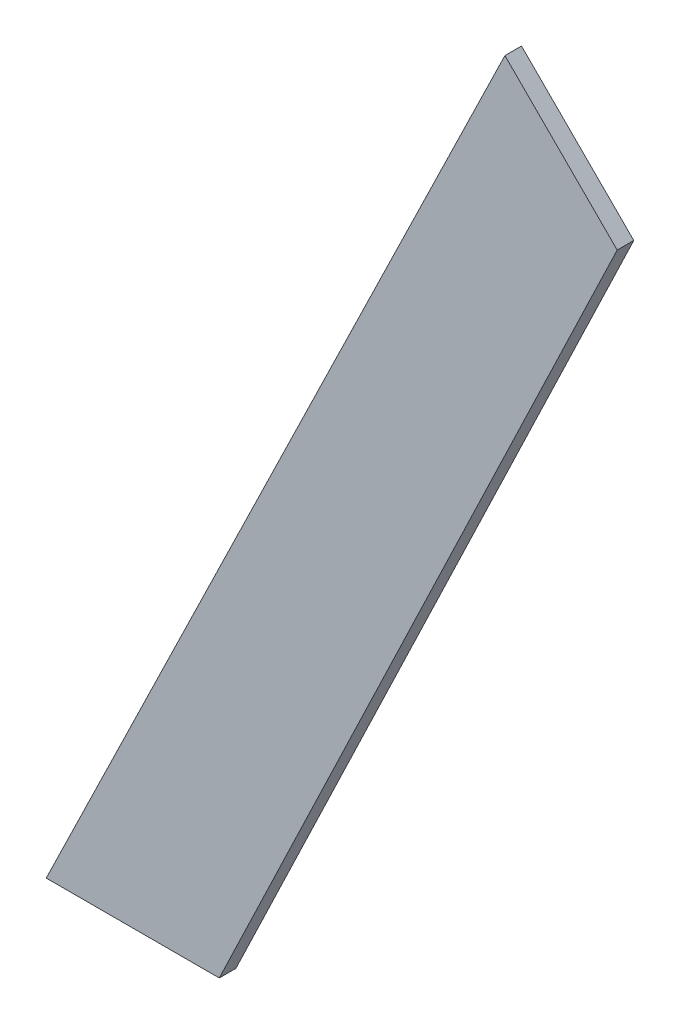
ISO-10303-21;
HEADER;
FILE_DESCRIPTION(('STEP AP214'),'2;1');
FILE_NAME('part.step','',(''),(''),'','','');
FILE_SCHEMA(('AUTOMOTIVE_DESIGN { 1 0 10303 214 1 1 1 1 }'));
ENDSEC;
DATA;
#1=APPLICATION_CONTEXT('core data for automotive mechanical design processes');
#2=APPLICATION_PROTOCOL_DEFINITION('international standard','automotive_design',2000,#1);
#3=PRODUCT_CONTEXT('',#1,'mechanical');
#4=PRODUCT('Part','Part','',(#3));
#5=PRODUCT_RELATED_PRODUCT_CATEGORY('part','',(#4));
#6=PRODUCT_DEFINITION_FORMATION('','',#4);
#7=PRODUCT_DEFINITION_CONTEXT('part definition',#1,'design');
#8=PRODUCT_DEFINITION('design','',#6,#7);
#9=PRODUCT_DEFINITION_SHAPE('','',#8);
#10=(LENGTH_UNIT() NAMED_UNIT(*) SI_UNIT(.MILLI.,.METRE.));
#11=(NAMED_UNIT(*) PLANE_ANGLE_UNIT() SI_UNIT($,.RADIAN.));
#12=(NAMED_UNIT(*) SI_UNIT($,.STERADIAN.) SOLID_ANGLE_UNIT());
#13=UNCERTAINTY_MEASURE_WITH_UNIT(LENGTH_MEASURE(1.E-05),#10,'distance_accuracy_value','');
#14=(GEOMETRIC_REPRESENTATION_CONTEXT(3) GLOBAL_UNCERTAINTY_ASSIGNED_CONTEXT((#13)) GLOBAL_UNIT_ASSIGNED_CONTEXT((#10,
#11,#12)) REPRESENTATION_CONTEXT('',''));
#15=CARTESIAN_POINT('',(0.,0.,0.));
#16=DIRECTION('',(0.,0.,1.));
#17=DIRECTION('',(1.,0.,0.));
#18=AXIS2_PLACEMENT_3D('',#15,#16,#17);
#19=CARTESIAN_POINT('',(0.,-79.1337905407471,-2.));
#20=DIRECTION('',(0.,-1.,0.));
#21=DIRECTION('',(0.,0.,-1.));
#22=AXIS2_PLACEMENT_3D('',#19,#20,#21);
#23=PLANE('',#22);
#24=DIRECTION('',(1.,0.,0.));
#25=VECTOR('',#24,1.);
#26=CARTESIAN_POINT('',(0.,-79.1337905407471,0.));
#27=LINE('',#26,#25);
#28=CARTESIAN_POINT('',(-227.315546686332,-79.1337905407471,0.));
#29=VERTEX_POINT('',#28);
#30=CARTESIAN_POINT('',(-206.44895129557,-79.1337905407471,0.));
#31=VERTEX_POINT('',#30);
#32=EDGE_CURVE('E99',#29,#31,#27,.T.);
#33=ORIENTED_EDGE('',*,*,#32,.F.);
#34=DIRECTION('',(0.,0.,1.));
#35=VECTOR('',#34,1.);
#36=CARTESIAN_POINT('',(-227.315546686332,-79.1337905407471,-2.));
#37=LINE('',#36,#35);
#38=CARTESIAN_POINT('',(-227.315546686332,-79.1337905407471,-2.));
#39=VERTEX_POINT('',#38);
#40=EDGE_CURVE('E11',#39,#29,#37,.T.);
#41=ORIENTED_EDGE('',*,*,#40,.F.);
#42=DIRECTION('',(1.,0.,0.));
#43=VECTOR('',#42,1.);
#44=CARTESIAN_POINT('',(0.,-79.1337905407471,-2.));
#45=LINE('',#44,#43);
#46=CARTESIAN_POINT('',(-206.44895129557,-79.1337905407471,-2.));
#47=VERTEX_POINT('',#46);
#48=EDGE_CURVE('E93',#39,#47,#45,.T.);
#49=ORIENTED_EDGE('',*,*,#48,.T.);
#50=DIRECTION('',(0.,0.,1.));
#51=VECTOR('',#50,1.);
#52=CARTESIAN_POINT('',(-206.44895129557,-79.1337905407471,-2.));
#53=LINE('',#52,#51);
#54=EDGE_CURVE('E38',#47,#31,#53,.T.);
#55=ORIENTED_EDGE('',*,*,#54,.T.);
#56=EDGE_LOOP('',(#33,#41,#49,#55));
#57=FACE_BOUND('',#56,.T.);
#58=ADVANCED_FACE('F35',(#57),#23,.T.);
#59=CARTESIAN_POINT('',(-152.566793655156,74.317769109974,-2.));
#60=DIRECTION('',(-0.899012240684183,0.437923499141123,0.));
#61=DIRECTION('',(-0.437923499141123,-0.899012240684183,0.));
#62=AXIS2_PLACEMENT_3D('',#59,#60,#61);
#63=PLANE('',#62);
#64=DIRECTION('',(-0.437923499141123,-0.899012240684183,0.));
#65=VECTOR('',#64,1.);
#66=CARTESIAN_POINT('',(-152.566793655156,74.317769109974,0.));
#67=LINE('',#66,#65);
#68=CARTESIAN_POINT('',(-172.009805753934,34.4032500059423,0.));
#69=VERTEX_POINT('',#68);
#70=EDGE_CURVE('E95',#69,#29,#67,.T.);
#71=ORIENTED_EDGE('',*,*,#70,.F.);
#72=DIRECTION('',(0.,0.,1.));
#73=VECTOR('',#72,1.);
#74=CARTESIAN_POINT('',(-172.009805753934,34.4032500059423,-2.));
#75=LINE('',#74,#73);
#76=CARTESIAN_POINT('',(-172.009805753934,34.4032500059423,-2.));
#77=VERTEX_POINT('',#76);
#78=EDGE_CURVE('E44',#77,#69,#75,.T.);
#79=ORIENTED_EDGE('',*,*,#78,.F.);
#80=DIRECTION('',(-0.437923499141123,-0.899012240684183,0.));
#81=VECTOR('',#80,1.);
#82=CARTESIAN_POINT('',(-152.566793655156,74.317769109974,-2.));
#83=LINE('',#82,#81);
#84=EDGE_CURVE('E90',#77,#39,#83,.T.);
#85=ORIENTED_EDGE('',*,*,#84,.T.);
#86=ORIENTED_EDGE('',*,*,#40,.T.);
#87=EDGE_LOOP('',(#71,#79,#85,#86));
#88=FACE_BOUND('',#87,.T.);
#89=ADVANCED_FACE('F109',(#88),#63,.T.);
#90=CARTESIAN_POINT('',(-68.8032778739952,-68.8032778739958,-2.));
#91=DIRECTION('',(0.707106781186544,0.707106781186551,0.));
#92=DIRECTION('',(-0.707106781186551,0.707106781186544,0.));
#93=AXIS2_PLACEMENT_3D('',#90,#91,#92);
#94=PLANE('',#93);
#95=DIRECTION('',(-0.707106781186551,0.707106781186544,0.));
#96=VECTOR('',#95,1.);
#97=CARTESIAN_POINT('',(-68.8032778739952,-68.8032778739958,0.));
#98=LINE('',#97,#96);
#99=CARTESIAN_POINT('',(-158.472765207245,20.8662094592529,0.));
#100=VERTEX_POINT('',#99);
#101=EDGE_CURVE('E85',#100,#69,#98,.T.);
#102=ORIENTED_EDGE('',*,*,#101,.F.);
#103=DIRECTION('',(0.,0.,1.));
#104=VECTOR('',#103,1.);
#105=CARTESIAN_POINT('',(-158.472765207245,20.8662094592529,-2.));
#106=LINE('',#105,#104);
#107=CARTESIAN_POINT('',(-158.472765207245,20.8662094592529,-2.));
#108=VERTEX_POINT('',#107);
#109=EDGE_CURVE('E80',#108,#100,#106,.T.);
#110=ORIENTED_EDGE('',*,*,#109,.F.);
#111=DIRECTION('',(-0.707106781186551,0.707106781186544,0.));
#112=VECTOR('',#111,1.);
#113=CARTESIAN_POINT('',(-68.8032778739952,-68.8032778739958,-2.));
#114=LINE('',#113,#112);
#115=EDGE_CURVE('E83',#108,#77,#114,.T.);
#116=ORIENTED_EDGE('',*,*,#115,.T.);
#117=ORIENTED_EDGE('',*,*,#78,.T.);
#118=EDGE_LOOP('',(#102,#110,#116,#117));
#119=FACE_BOUND('',#118,.T.);
#120=ADVANCED_FACE('F82',(#119),#94,.T.);
#121=CARTESIAN_POINT('',(-136.959427585521,65.707909843934,-2.));
#122=DIRECTION('',(0.901606801768423,-0.432556557001412,0.));
#123=DIRECTION('',(0.432556557001412,0.901606801768423,0.));
#124=AXIS2_PLACEMENT_3D('',#121,#122,#123);
#125=PLANE('',#124);
#126=DIRECTION('',(0.432556557001412,0.901606801768423,0.));
#127=VECTOR('',#126,1.);
#128=CARTESIAN_POINT('',(-136.959427585521,65.707909843934,0.));
#129=LINE('',#128,#127);
#130=EDGE_CURVE('E102',#31,#100,#129,.T.);
#131=ORIENTED_EDGE('',*,*,#130,.F.);
#132=ORIENTED_EDGE('',*,*,#54,.F.);
#133=DIRECTION('',(0.432556557001412,0.901606801768423,0.));
#134=VECTOR('',#133,1.);
#135=CARTESIAN_POINT('',(-136.959427585521,65.707909843934,-2.));
#136=LINE('',#135,#134);
#137=EDGE_CURVE('E89',#47,#108,#136,.T.);
#138=ORIENTED_EDGE('',*,*,#137,.T.);
#139=ORIENTED_EDGE('',*,*,#109,.T.);
#140=EDGE_LOOP('',(#131,#132,#138,#139));
#141=FACE_BOUND('',#140,.T.);
#142=ADVANCED_FACE('F92',(#141),#125,.T.);
#143=CARTESIAN_POINT('',(0.,0.,-2.));
#144=DIRECTION('',(0.,0.,1.));
#145=DIRECTION('',(1.,0.,0.));
#146=AXIS2_PLACEMENT_3D('',#143,#144,#145);
#147=PLANE('',#146);
#148=ORIENTED_EDGE('',*,*,#48,.F.);
#149=ORIENTED_EDGE('',*,*,#84,.F.);
#150=ORIENTED_EDGE('',*,*,#115,.F.);
#151=ORIENTED_EDGE('',*,*,#137,.F.);
#152=EDGE_LOOP('',(#148,#149,#150,#151));
#153=FACE_BOUND('',#152,.T.);
#154=ADVANCED_FACE('F88',(#153),#147,.F.);
#155=CARTESIAN_POINT('',(0.,0.,0.));
#156=DIRECTION('',(0.,0.,1.));
#157=DIRECTION('',(1.,0.,0.));
#158=AXIS2_PLACEMENT_3D('',#155,#156,#157);
#159=PLANE('',#158);
#160=ORIENTED_EDGE('',*,*,#32,.T.);
#161=ORIENTED_EDGE('',*,*,#130,.T.);
#162=ORIENTED_EDGE('',*,*,#101,.T.);
#163=ORIENTED_EDGE('',*,*,#70,.T.);
#164=EDGE_LOOP('',(#160,#161,#162,#163));
#165=FACE_BOUND('',#164,.T.);
#166=ADVANCED_FACE('F108',(#165),#159,.T.);
#167=CLOSED_SHELL('',(#58,#89,#120,#142,#154,#166));
#168=MANIFOLD_SOLID_BREP('B2',#167);
#169=ADVANCED_BREP_SHAPE_REPRESENTATION('',(#18,#168),#14);
#170=SHAPE_DEFINITION_REPRESENTATION(#9,#169);
ENDSEC;
END-ISO-10303-21;
